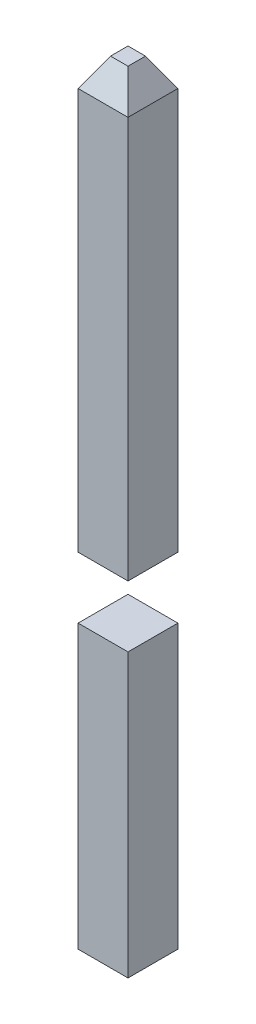
ISO-10303-21;
HEADER;
FILE_DESCRIPTION(('STEP AP214'),'2;1');
FILE_NAME('part.step','',(''),(''),'','','');
FILE_SCHEMA(('AUTOMOTIVE_DESIGN { 1 0 10303 214 1 1 1 1 }'));
ENDSEC;
DATA;
#1=APPLICATION_CONTEXT('core data for automotive mechanical design processes');
#2=APPLICATION_PROTOCOL_DEFINITION('international standard','automotive_design',2000,#1);
#3=PRODUCT_CONTEXT('',#1,'mechanical');
#4=PRODUCT('Part','Part','',(#3));
#5=PRODUCT_RELATED_PRODUCT_CATEGORY('part','',(#4));
#6=PRODUCT_DEFINITION_FORMATION('','',#4);
#7=PRODUCT_DEFINITION_CONTEXT('part definition',#1,'design');
#8=PRODUCT_DEFINITION('design','',#6,#7);
#9=PRODUCT_DEFINITION_SHAPE('','',#8);
#10=(LENGTH_UNIT() NAMED_UNIT(*) SI_UNIT(.MILLI.,.METRE.));
#11=(NAMED_UNIT(*) PLANE_ANGLE_UNIT() SI_UNIT($,.RADIAN.));
#12=(NAMED_UNIT(*) SI_UNIT($,.STERADIAN.) SOLID_ANGLE_UNIT());
#13=UNCERTAINTY_MEASURE_WITH_UNIT(LENGTH_MEASURE(1.E-05),#10,'distance_accuracy_value','');
#14=(GEOMETRIC_REPRESENTATION_CONTEXT(3) GLOBAL_UNCERTAINTY_ASSIGNED_CONTEXT((#13)) GLOBAL_UNIT_ASSIGNED_CONTEXT((#10,
#11,#12)) REPRESENTATION_CONTEXT('',''));
#15=CARTESIAN_POINT('',(0.,0.,0.));
#16=DIRECTION('',(0.,0.,1.));
#17=DIRECTION('',(1.,0.,0.));
#18=AXIS2_PLACEMENT_3D('',#15,#16,#17);
#19=CARTESIAN_POINT('',(-0.2032,2.9718,-0.2032));
#20=DIRECTION('',(-1.,0.,0.));
#21=DIRECTION('',(0.,0.,1.));
#22=AXIS2_PLACEMENT_3D('',#19,#20,#21);
#23=PLANE('',#22);
#24=DIRECTION('',(0.,1.,0.));
#25=VECTOR('',#24,1.);
#26=CARTESIAN_POINT('',(-0.2032,2.9718,-0.2032));
#27=LINE('',#26,#25);
#28=CARTESIAN_POINT('',(-0.2032,-2.23357,-0.2032));
#29=VERTEX_POINT('',#28);
#30=CARTESIAN_POINT('',(-0.2032,0.0668000000000001,-0.2032));
#31=VERTEX_POINT('',#30);
#32=EDGE_CURVE('P0_E52',#29,#31,#27,.T.);
#33=ORIENTED_EDGE('',*,*,#32,.F.);
#34=DIRECTION('',(0.,0.,1.));
#35=VECTOR('',#34,1.);
#36=CARTESIAN_POINT('',(-0.2032,-2.23357,-0.2032));
#37=LINE('',#36,#35);
#38=CARTESIAN_POINT('',(-0.2032,-2.23357,0.2032));
#39=VERTEX_POINT('',#38);
#40=EDGE_CURVE('P0_E19',#29,#39,#37,.T.);
#41=ORIENTED_EDGE('',*,*,#40,.T.);
#42=DIRECTION('',(0.,1.,0.));
#43=VECTOR('',#42,1.);
#44=CARTESIAN_POINT('',(-0.2032,2.9718,0.2032));
#45=LINE('',#44,#43);
#46=CARTESIAN_POINT('',(-0.2032,0.0668000000000001,0.2032));
#47=VERTEX_POINT('',#46);
#48=EDGE_CURVE('P0_E66',#39,#47,#45,.T.);
#49=ORIENTED_EDGE('',*,*,#48,.T.);
#50=DIRECTION('',(0.,0.,-1.));
#51=VECTOR('',#50,1.);
#52=CARTESIAN_POINT('',(-0.2032,0.0668,2.54));
#53=LINE('',#52,#51);
#54=EDGE_CURVE('P0_E57',#47,#31,#53,.T.);
#55=ORIENTED_EDGE('',*,*,#54,.T.);
#56=EDGE_LOOP('',(#33,#41,#49,#55));
#57=FACE_BOUND('',#56,.T.);
#58=ADVANCED_FACE('P0_F16',(#57),#23,.T.);
#59=CARTESIAN_POINT('',(4.796879710211,2.9718,0.2032));
#60=DIRECTION('',(0.,0.,-1.));
#61=DIRECTION('',(-1.,0.,0.));
#62=AXIS2_PLACEMENT_3D('',#59,#60,#61);
#63=PLANE('',#62);
#64=DIRECTION('',(0.,1.,0.));
#65=VECTOR('',#64,1.);
#66=CARTESIAN_POINT('',(0.2032,2.9718,0.2032));
#67=LINE('',#66,#65);
#68=CARTESIAN_POINT('',(0.2032,-2.23357,0.2032));
#69=VERTEX_POINT('',#68);
#70=CARTESIAN_POINT('',(0.2032,0.0668000000000001,0.2032));
#71=VERTEX_POINT('',#70);
#72=EDGE_CURVE('P0_E74',#69,#71,#67,.T.);
#73=ORIENTED_EDGE('',*,*,#72,.T.);
#74=DIRECTION('',(1.,0.,0.));
#75=VECTOR('',#74,1.);
#76=CARTESIAN_POINT('',(-0.635,0.0668,0.2032));
#77=LINE('',#76,#75);
#78=EDGE_CURVE('P0_E62',#71,#47,#77,.F.);
#79=ORIENTED_EDGE('',*,*,#78,.T.);
#80=ORIENTED_EDGE('',*,*,#48,.F.);
#81=DIRECTION('',(1.,0.,0.));
#82=VECTOR('',#81,1.);
#83=CARTESIAN_POINT('',(0.9954943082875,-2.23357,0.2032));
#84=LINE('',#83,#82);
#85=EDGE_CURVE('P0_E80',#39,#69,#84,.T.);
#86=ORIENTED_EDGE('',*,*,#85,.T.);
#87=EDGE_LOOP('',(#73,#79,#80,#86));
#88=FACE_BOUND('',#87,.T.);
#89=ADVANCED_FACE('P0_F73',(#88),#63,.F.);
#90=CARTESIAN_POINT('',(-0.635,0.0668,2.54));
#91=DIRECTION('',(0.,-1.,0.));
#92=DIRECTION('',(0.,0.,-1.));
#93=AXIS2_PLACEMENT_3D('',#90,#91,#92);
#94=PLANE('',#93);
#95=DIRECTION('',(0.,0.,1.));
#96=VECTOR('',#95,1.);
#97=CARTESIAN_POINT('',(0.2032,0.0668000000000001,-0.2032));
#98=LINE('',#97,#96);
#99=CARTESIAN_POINT('',(0.2032,0.0668000000000001,-0.2032));
#100=VERTEX_POINT('',#99);
#101=EDGE_CURVE('P0_E83',#71,#100,#98,.F.);
#102=ORIENTED_EDGE('',*,*,#101,.T.);
#103=DIRECTION('',(-1.,0.,0.));
#104=VECTOR('',#103,1.);
#105=CARTESIAN_POINT('',(4.796879710211,0.0668000000000001,-0.2032));
#106=LINE('',#105,#104);
#107=EDGE_CURVE('P0_E64',#31,#100,#106,.F.);
#108=ORIENTED_EDGE('',*,*,#107,.F.);
#109=ORIENTED_EDGE('',*,*,#54,.F.);
#110=ORIENTED_EDGE('',*,*,#78,.F.);
#111=EDGE_LOOP('',(#102,#108,#109,#110));
#112=FACE_BOUND('',#111,.T.);
#113=ADVANCED_FACE('P0_F60',(#112),#94,.F.);
#114=CARTESIAN_POINT('',(4.796879710211,2.9718,-0.2032));
#115=DIRECTION('',(0.,0.,-1.));
#116=DIRECTION('',(-1.,0.,0.));
#117=AXIS2_PLACEMENT_3D('',#114,#115,#116);
#118=PLANE('',#117);
#119=DIRECTION('',(0.,1.,0.));
#120=VECTOR('',#119,1.);
#121=CARTESIAN_POINT('',(0.2032,2.9718,-0.2032));
#122=LINE('',#121,#120);
#123=CARTESIAN_POINT('',(0.2032,-2.23357,-0.2032));
#124=VERTEX_POINT('',#123);
#125=EDGE_CURVE('P0_E25',#100,#124,#122,.F.);
#126=ORIENTED_EDGE('',*,*,#125,.T.);
#127=DIRECTION('',(1.,0.,0.));
#128=VECTOR('',#127,1.);
#129=CARTESIAN_POINT('',(0.9954943082875,-2.23357,-0.2032));
#130=LINE('',#129,#128);
#131=EDGE_CURVE('P0_E33',#124,#29,#130,.F.);
#132=ORIENTED_EDGE('',*,*,#131,.T.);
#133=ORIENTED_EDGE('',*,*,#32,.T.);
#134=ORIENTED_EDGE('',*,*,#107,.T.);
#135=EDGE_LOOP('',(#126,#132,#133,#134));
#136=FACE_BOUND('',#135,.T.);
#137=ADVANCED_FACE('P0_F87',(#136),#118,.T.);
#138=CARTESIAN_POINT('',(0.9954943082875,-2.23357,0.2032));
#139=DIRECTION('',(0.,1.,0.));
#140=DIRECTION('',(0.,0.,1.));
#141=AXIS2_PLACEMENT_3D('',#138,#139,#140);
#142=PLANE('',#141);
#143=ORIENTED_EDGE('',*,*,#40,.F.);
#144=ORIENTED_EDGE('',*,*,#131,.F.);
#145=DIRECTION('',(0.,0.,1.));
#146=VECTOR('',#145,1.);
#147=CARTESIAN_POINT('',(0.2032,-2.23357,-0.2032));
#148=LINE('',#147,#146);
#149=EDGE_CURVE('P0_E11',#124,#69,#148,.T.);
#150=ORIENTED_EDGE('',*,*,#149,.T.);
#151=ORIENTED_EDGE('',*,*,#85,.F.);
#152=EDGE_LOOP('',(#143,#144,#150,#151));
#153=FACE_BOUND('',#152,.T.);
#154=ADVANCED_FACE('P0_F90',(#153),#142,.F.);
#155=CARTESIAN_POINT('',(0.2032,2.9718,-0.2032));
#156=DIRECTION('',(-1.,0.,0.));
#157=DIRECTION('',(0.,0.,1.));
#158=AXIS2_PLACEMENT_3D('',#155,#156,#157);
#159=PLANE('',#158);
#160=ORIENTED_EDGE('',*,*,#125,.F.);
#161=ORIENTED_EDGE('',*,*,#101,.F.);
#162=ORIENTED_EDGE('',*,*,#72,.F.);
#163=ORIENTED_EDGE('',*,*,#149,.F.);
#164=EDGE_LOOP('',(#160,#161,#162,#163));
#165=FACE_BOUND('',#164,.T.);
#166=ADVANCED_FACE('P0_F89',(#165),#159,.F.);
#167=CLOSED_SHELL('',(#58,#89,#113,#137,#154,#166));
#168=MANIFOLD_SOLID_BREP('P0_B1',#167);
#169=CARTESIAN_POINT('',(-0.07121772846325,4.06643,-0.2032));
#170=DIRECTION('',(-0.866025403784429,0.500000000000017,0.));
#171=DIRECTION('',(-0.500000000000017,-0.866025403784429,0.));
#172=AXIS2_PLACEMENT_3D('',#169,#170,#171);
#173=PLANE('',#172);
#174=DIRECTION('',(0.,0.,-1.));
#175=VECTOR('',#174,1.);
#176=CARTESIAN_POINT('',(-0.0712177284632499,4.06643,-0.2032));
#177=LINE('',#176,#175);
#178=CARTESIAN_POINT('',(-0.0712177284632502,4.06643,0.0712177284632479));
#179=VERTEX_POINT('',#178);
#180=CARTESIAN_POINT('',(-0.0712177284632502,4.06643,-0.0712177284632502));
#181=VERTEX_POINT('',#180);
#182=EDGE_CURVE('P1_E66',#179,#181,#177,.T.);
#183=ORIENTED_EDGE('',*,*,#182,.T.);
#184=DIRECTION('',(0.447213595499966,0.774596669241471,0.447213595499971));
#185=VECTOR('',#184,1.);
#186=CARTESIAN_POINT('',(-0.203200000000001,3.83783,-0.203200000000003));
#187=LINE('',#186,#185);
#188=CARTESIAN_POINT('',(-0.203200000000002,3.83783,-0.203200000000001));
#189=VERTEX_POINT('',#188);
#190=EDGE_CURVE('P1_E72',#189,#181,#187,.T.);
#191=ORIENTED_EDGE('',*,*,#190,.F.);
#192=DIRECTION('',(0.,0.,1.));
#193=VECTOR('',#192,1.);
#194=CARTESIAN_POINT('',(-0.2032,3.83783,-0.2032));
#195=LINE('',#194,#193);
#196=CARTESIAN_POINT('',(-0.203200000000002,3.83783,0.2032));
#197=VERTEX_POINT('',#196);
#198=EDGE_CURVE('P1_E19',#197,#189,#195,.F.);
#199=ORIENTED_EDGE('',*,*,#198,.F.);
#200=DIRECTION('',(0.447213595499965,0.774596669241472,-0.447213595499971));
#201=VECTOR('',#200,1.);
#202=CARTESIAN_POINT('',(-0.203200000000001,3.83783,0.2032));
#203=LINE('',#202,#201);
#204=EDGE_CURVE('P1_E82',#197,#179,#203,.T.);
#205=ORIENTED_EDGE('',*,*,#204,.T.);
#206=EDGE_LOOP('',(#183,#191,#199,#205));
#207=FACE_BOUND('',#206,.T.);
#208=ADVANCED_FACE('P1_F16',(#207),#173,.T.);
#209=CARTESIAN_POINT('',(-0.2032,2.9718,-0.2032));
#210=DIRECTION('',(-1.,0.,0.));
#211=DIRECTION('',(0.,0.,1.));
#212=AXIS2_PLACEMENT_3D('',#209,#210,#211);
#213=PLANE('',#212);
#214=DIRECTION('',(0.,1.,0.));
#215=VECTOR('',#214,1.);
#216=CARTESIAN_POINT('',(-0.2032,2.9718,0.2032));
#217=LINE('',#216,#215);
#218=CARTESIAN_POINT('',(-0.2032,0.5668,0.2032));
#219=VERTEX_POINT('',#218);
#220=EDGE_CURVE('P1_E102',#219,#197,#217,.T.);
#221=ORIENTED_EDGE('',*,*,#220,.T.);
#222=ORIENTED_EDGE('',*,*,#198,.T.);
#223=DIRECTION('',(0.,1.,0.));
#224=VECTOR('',#223,1.);
#225=CARTESIAN_POINT('',(-0.2032,2.9718,-0.2032));
#226=LINE('',#225,#224);
#227=CARTESIAN_POINT('',(-0.2032,0.5668,-0.2032));
#228=VERTEX_POINT('',#227);
#229=EDGE_CURVE('P1_E91',#228,#189,#226,.T.);
#230=ORIENTED_EDGE('',*,*,#229,.F.);
#231=DIRECTION('',(0.,0.,-1.));
#232=VECTOR('',#231,1.);
#233=CARTESIAN_POINT('',(-0.2032,0.5668,2.54));
#234=LINE('',#233,#232);
#235=EDGE_CURVE('P1_E95',#219,#228,#234,.T.);
#236=ORIENTED_EDGE('',*,*,#235,.F.);
#237=EDGE_LOOP('',(#221,#222,#230,#236));
#238=FACE_BOUND('',#237,.T.);
#239=ADVANCED_FACE('P1_F156',(#238),#213,.T.);
#240=CARTESIAN_POINT('',(4.796879710211,4.06643,-0.2032));
#241=DIRECTION('',(0.,-1.,0.));
#242=DIRECTION('',(0.,0.,-1.));
#243=AXIS2_PLACEMENT_3D('',#240,#241,#242);
#244=PLANE('',#243);
#245=DIRECTION('',(1.,0.,0.));
#246=VECTOR('',#245,1.);
#247=CARTESIAN_POINT('',(4.796879710211,4.06643,0.0712177284632465));
#248=LINE('',#247,#246);
#249=CARTESIAN_POINT('',(0.0712177284632487,4.06643,0.0712177284632479));
#250=VERTEX_POINT('',#249);
#251=EDGE_CURVE('P1_E87',#179,#250,#248,.T.);
#252=ORIENTED_EDGE('',*,*,#251,.T.);
#253=DIRECTION('',(0.,0.,1.));
#254=VECTOR('',#253,1.);
#255=CARTESIAN_POINT('',(0.071217728463247,4.06643,-0.2032));
#256=LINE('',#255,#254);
#257=CARTESIAN_POINT('',(0.0712177284632485,4.06643,-0.07121772846325));
#258=VERTEX_POINT('',#257);
#259=EDGE_CURVE('P1_E85',#250,#258,#256,.F.);
#260=ORIENTED_EDGE('',*,*,#259,.T.);
#261=DIRECTION('',(1.,0.,0.));
#262=VECTOR('',#261,1.);
#263=CARTESIAN_POINT('',(4.796879710211,4.06643,-0.07121772846325));
#264=LINE('',#263,#262);
#265=EDGE_CURVE('P1_E75',#181,#258,#264,.T.);
#266=ORIENTED_EDGE('',*,*,#265,.F.);
#267=ORIENTED_EDGE('',*,*,#182,.F.);
#268=EDGE_LOOP('',(#252,#260,#266,#267));
#269=FACE_BOUND('',#268,.T.);
#270=ADVANCED_FACE('P1_F84',(#269),#244,.F.);
#271=CARTESIAN_POINT('',(4.796879710211,4.06643,-0.07121772846325));
#272=DIRECTION('',(0.,0.500000000000017,-0.866025403784429));
#273=DIRECTION('',(0.,0.866025403784429,0.500000000000017));
#274=AXIS2_PLACEMENT_3D('',#271,#272,#273);
#275=PLANE('',#274);
#276=ORIENTED_EDGE('',*,*,#265,.T.);
#277=DIRECTION('',(0.447213595499971,-0.774596669241471,-0.447213595499967));
#278=VECTOR('',#277,1.);
#279=CARTESIAN_POINT('',(0.071217728463247,4.06643,-0.0712177284632501));
#280=LINE('',#279,#278);
#281=CARTESIAN_POINT('',(0.2032,3.83783,-0.203200000000002));
#282=VERTEX_POINT('',#281);
#283=EDGE_CURVE('P1_E108',#258,#282,#280,.T.);
#284=ORIENTED_EDGE('',*,*,#283,.T.);
#285=DIRECTION('',(-1.,0.,0.));
#286=VECTOR('',#285,1.);
#287=CARTESIAN_POINT('',(4.796879710211,3.83783,-0.2032));
#288=LINE('',#287,#286);
#289=EDGE_CURVE('P1_E77',#189,#282,#288,.F.);
#290=ORIENTED_EDGE('',*,*,#289,.F.);
#291=ORIENTED_EDGE('',*,*,#190,.T.);
#292=EDGE_LOOP('',(#276,#284,#290,#291));
#293=FACE_BOUND('',#292,.T.);
#294=ADVANCED_FACE('P1_F73',(#293),#275,.T.);
#295=CARTESIAN_POINT('',(4.796879710211,3.83783,0.2032));
#296=DIRECTION('',(0.,-0.500000000000017,-0.866025403784429));
#297=DIRECTION('',(0.,0.866025403784429,-0.500000000000017));
#298=AXIS2_PLACEMENT_3D('',#295,#296,#297);
#299=PLANE('',#298);
#300=ORIENTED_EDGE('',*,*,#251,.F.);
#301=ORIENTED_EDGE('',*,*,#204,.F.);
#302=DIRECTION('',(-1.,0.,0.));
#303=VECTOR('',#302,1.);
#304=CARTESIAN_POINT('',(4.796879710211,3.83783,0.2032));
#305=LINE('',#304,#303);
#306=CARTESIAN_POINT('',(0.2032,3.83783,0.2032));
#307=VERTEX_POINT('',#306);
#308=EDGE_CURVE('P1_E105',#197,#307,#305,.F.);
#309=ORIENTED_EDGE('',*,*,#308,.T.);
#310=DIRECTION('',(-0.447213595499971,0.774596669241471,-0.447213595499966));
#311=VECTOR('',#310,1.);
#312=CARTESIAN_POINT('',(0.2032,3.83783,0.2032));
#313=LINE('',#312,#311);
#314=EDGE_CURVE('P1_E33',#307,#250,#313,.T.);
#315=ORIENTED_EDGE('',*,*,#314,.T.);
#316=EDGE_LOOP('',(#300,#301,#309,#315));
#317=FACE_BOUND('',#316,.T.);
#318=ADVANCED_FACE('P1_F149',(#317),#299,.F.);
#319=CARTESIAN_POINT('',(4.796879710211,2.9718,-0.2032));
#320=DIRECTION('',(0.,0.,-1.));
#321=DIRECTION('',(-1.,0.,0.));
#322=AXIS2_PLACEMENT_3D('',#319,#320,#321);
#323=PLANE('',#322);
#324=ORIENTED_EDGE('',*,*,#229,.T.);
#325=ORIENTED_EDGE('',*,*,#289,.T.);
#326=DIRECTION('',(0.,1.,0.));
#327=VECTOR('',#326,1.);
#328=CARTESIAN_POINT('',(0.2032,2.9718,-0.203200000000002));
#329=LINE('',#328,#327);
#330=CARTESIAN_POINT('',(0.2032,0.5668,-0.2032));
#331=VERTEX_POINT('',#330);
#332=EDGE_CURVE('P1_E111',#282,#331,#329,.F.);
#333=ORIENTED_EDGE('',*,*,#332,.T.);
#334=DIRECTION('',(1.,0.,0.));
#335=VECTOR('',#334,1.);
#336=CARTESIAN_POINT('',(-0.635,0.5668,-0.2032));
#337=LINE('',#336,#335);
#338=EDGE_CURVE('P1_E97',#228,#331,#337,.T.);
#339=ORIENTED_EDGE('',*,*,#338,.F.);
#340=EDGE_LOOP('',(#324,#325,#333,#339));
#341=FACE_BOUND('',#340,.T.);
#342=ADVANCED_FACE('P1_F133',(#341),#323,.T.);
#343=CARTESIAN_POINT('',(-0.635,0.5668,2.54));
#344=DIRECTION('',(0.,-1.,0.));
#345=DIRECTION('',(0.,0.,-1.));
#346=AXIS2_PLACEMENT_3D('',#343,#344,#345);
#347=PLANE('',#346);
#348=DIRECTION('',(0.,0.,1.));
#349=VECTOR('',#348,1.);
#350=CARTESIAN_POINT('',(0.2032,0.5668,-0.2032));
#351=LINE('',#350,#349);
#352=CARTESIAN_POINT('',(0.2032,0.5668,0.2032));
#353=VERTEX_POINT('',#352);
#354=EDGE_CURVE('P1_E114',#331,#353,#351,.T.);
#355=ORIENTED_EDGE('',*,*,#354,.T.);
#356=DIRECTION('',(-1.,0.,0.));
#357=VECTOR('',#356,1.);
#358=CARTESIAN_POINT('',(4.796879710211,0.5668,0.2032));
#359=LINE('',#358,#357);
#360=EDGE_CURVE('P1_E99',#353,#219,#359,.T.);
#361=ORIENTED_EDGE('',*,*,#360,.T.);
#362=ORIENTED_EDGE('',*,*,#235,.T.);
#363=ORIENTED_EDGE('',*,*,#338,.T.);
#364=EDGE_LOOP('',(#355,#361,#362,#363));
#365=FACE_BOUND('',#364,.T.);
#366=ADVANCED_FACE('P1_F129',(#365),#347,.T.);
#367=CARTESIAN_POINT('',(4.796879710211,2.9718,0.2032));
#368=DIRECTION('',(0.,0.,-1.));
#369=DIRECTION('',(-1.,0.,0.));
#370=AXIS2_PLACEMENT_3D('',#367,#368,#369);
#371=PLANE('',#370);
#372=ORIENTED_EDGE('',*,*,#220,.F.);
#373=ORIENTED_EDGE('',*,*,#360,.F.);
#374=DIRECTION('',(0.,1.,0.));
#375=VECTOR('',#374,1.);
#376=CARTESIAN_POINT('',(0.2032,2.9718,0.2032));
#377=LINE('',#376,#375);
#378=EDGE_CURVE('P1_E25',#353,#307,#377,.T.);
#379=ORIENTED_EDGE('',*,*,#378,.T.);
#380=ORIENTED_EDGE('',*,*,#308,.F.);
#381=EDGE_LOOP('',(#372,#373,#379,#380));
#382=FACE_BOUND('',#381,.T.);
#383=ADVANCED_FACE('P1_F122',(#382),#371,.F.);
#384=CARTESIAN_POINT('',(0.2032,3.83783,-0.2032));
#385=DIRECTION('',(-0.866025403784429,-0.500000000000017,0.));
#386=DIRECTION('',(0.500000000000017,-0.866025403784429,0.));
#387=AXIS2_PLACEMENT_3D('',#384,#385,#386);
#388=PLANE('',#387);
#389=DIRECTION('',(0.,0.,1.));
#390=VECTOR('',#389,1.);
#391=CARTESIAN_POINT('',(0.2032,3.83783,-0.2032));
#392=LINE('',#391,#390);
#393=EDGE_CURVE('P1_E11',#307,#282,#392,.F.);
#394=ORIENTED_EDGE('',*,*,#393,.T.);
#395=ORIENTED_EDGE('',*,*,#283,.F.);
#396=ORIENTED_EDGE('',*,*,#259,.F.);
#397=ORIENTED_EDGE('',*,*,#314,.F.);
#398=EDGE_LOOP('',(#394,#395,#396,#397));
#399=FACE_BOUND('',#398,.T.);
#400=ADVANCED_FACE('P1_F134',(#399),#388,.F.);
#401=CARTESIAN_POINT('',(0.2032,2.9718,-0.2032));
#402=DIRECTION('',(-1.,0.,0.));
#403=DIRECTION('',(0.,0.,1.));
#404=AXIS2_PLACEMENT_3D('',#401,#402,#403);
#405=PLANE('',#404);
#406=ORIENTED_EDGE('',*,*,#378,.F.);
#407=ORIENTED_EDGE('',*,*,#354,.F.);
#408=ORIENTED_EDGE('',*,*,#332,.F.);
#409=ORIENTED_EDGE('',*,*,#393,.F.);
#410=EDGE_LOOP('',(#406,#407,#408,#409));
#411=FACE_BOUND('',#410,.T.);
#412=ADVANCED_FACE('P1_F126',(#411),#405,.F.);
#413=CLOSED_SHELL('',(#208,#239,#270,#294,#318,#342,#366,#383,#400,#412));
#414=MANIFOLD_SOLID_BREP('P1_B1',#413);
#415=ADVANCED_BREP_SHAPE_REPRESENTATION('',(#18,#168,#414),#14);
#416=SHAPE_DEFINITION_REPRESENTATION(#9,#415);
ENDSEC;
END-ISO-10303-21;
